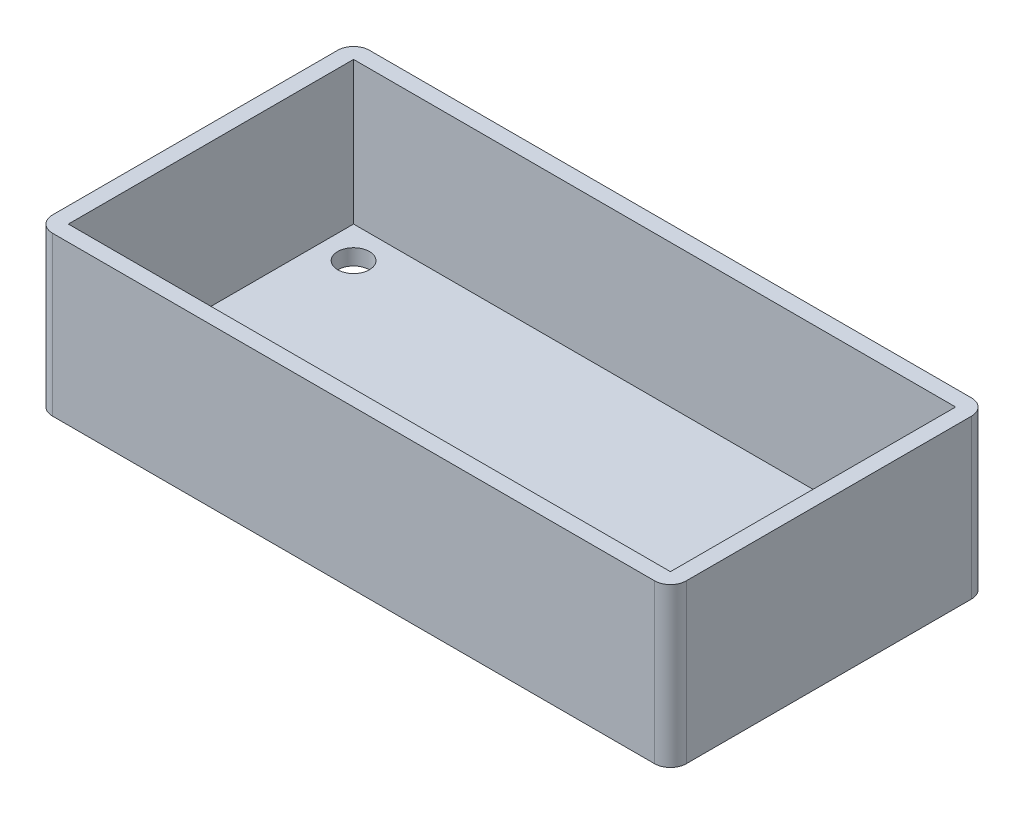
ISO-10303-21;
HEADER;
FILE_DESCRIPTION(('STEP AP214'),'2;1');
FILE_NAME('part.step','',(''),(''),'','','');
FILE_SCHEMA(('AUTOMOTIVE_DESIGN { 1 0 10303 214 1 1 1 1 }'));
ENDSEC;
DATA;
#1=APPLICATION_CONTEXT('core data for automotive mechanical design processes');
#2=APPLICATION_PROTOCOL_DEFINITION('international standard','automotive_design',2000,#1);
#3=PRODUCT_CONTEXT('',#1,'mechanical');
#4=PRODUCT('Part','Part','',(#3));
#5=PRODUCT_RELATED_PRODUCT_CATEGORY('part','',(#4));
#6=PRODUCT_DEFINITION_FORMATION('','',#4);
#7=PRODUCT_DEFINITION_CONTEXT('part definition',#1,'design');
#8=PRODUCT_DEFINITION('design','',#6,#7);
#9=PRODUCT_DEFINITION_SHAPE('','',#8);
#10=(LENGTH_UNIT() NAMED_UNIT(*) SI_UNIT(.MILLI.,.METRE.));
#11=(NAMED_UNIT(*) PLANE_ANGLE_UNIT() SI_UNIT($,.RADIAN.));
#12=(NAMED_UNIT(*) SI_UNIT($,.STERADIAN.) SOLID_ANGLE_UNIT());
#13=UNCERTAINTY_MEASURE_WITH_UNIT(LENGTH_MEASURE(1.E-05),#10,'distance_accuracy_value','');
#14=(GEOMETRIC_REPRESENTATION_CONTEXT(3) GLOBAL_UNCERTAINTY_ASSIGNED_CONTEXT((#13)) GLOBAL_UNIT_ASSIGNED_CONTEXT((#10,
#11,#12)) REPRESENTATION_CONTEXT('',''));
#15=CARTESIAN_POINT('',(0.,0.,0.));
#16=DIRECTION('',(0.,0.,1.));
#17=DIRECTION('',(1.,0.,0.));
#18=AXIS2_PLACEMENT_3D('',#15,#16,#17);
#19=CARTESIAN_POINT('',(-100.,50.,50.));
#20=DIRECTION('',(1.,0.,0.));
#21=DIRECTION('',(0.,0.,-1.));
#22=AXIS2_PLACEMENT_3D('',#19,#20,#21);
#23=PLANE('',#22);
#24=DIRECTION('',(0.,0.,1.));
#25=VECTOR('',#24,1.);
#26=CARTESIAN_POINT('',(-100.,0.,50.));
#27=LINE('',#26,#25);
#28=CARTESIAN_POINT('',(-100.,0.,-45.));
#29=VERTEX_POINT('',#28);
#30=CARTESIAN_POINT('',(-100.,0.,45.));
#31=VERTEX_POINT('',#30);
#32=EDGE_CURVE('E192',#29,#31,#27,.T.);
#33=ORIENTED_EDGE('',*,*,#32,.T.);
#34=DIRECTION('',(0.,-1.,0.));
#35=VECTOR('',#34,1.);
#36=CARTESIAN_POINT('',(-100.,50.,45.));
#37=LINE('',#36,#35);
#38=CARTESIAN_POINT('',(-100.,50.,45.));
#39=VERTEX_POINT('',#38);
#40=EDGE_CURVE('E11',#31,#39,#37,.F.);
#41=ORIENTED_EDGE('',*,*,#40,.T.);
#42=DIRECTION('',(0.,0.,1.));
#43=VECTOR('',#42,1.);
#44=CARTESIAN_POINT('',(-100.,50.,50.));
#45=LINE('',#44,#43);
#46=CARTESIAN_POINT('',(-100.,50.,-45.));
#47=VERTEX_POINT('',#46);
#48=EDGE_CURVE('E176',#47,#39,#45,.T.);
#49=ORIENTED_EDGE('',*,*,#48,.F.);
#50=DIRECTION('',(0.,-1.,0.));
#51=VECTOR('',#50,1.);
#52=CARTESIAN_POINT('',(-100.,50.,-45.));
#53=LINE('',#52,#51);
#54=EDGE_CURVE('E48',#47,#29,#53,.T.);
#55=ORIENTED_EDGE('',*,*,#54,.T.);
#56=EDGE_LOOP('',(#33,#41,#49,#55));
#57=FACE_BOUND('',#56,.T.);
#58=ADVANCED_FACE('F39',(#57),#23,.F.);
#59=CARTESIAN_POINT('',(100.,50.,50.));
#60=DIRECTION('',(0.,0.,-1.));
#61=DIRECTION('',(-1.,0.,0.));
#62=AXIS2_PLACEMENT_3D('',#59,#60,#61);
#63=PLANE('',#62);
#64=DIRECTION('',(1.,0.,0.));
#65=VECTOR('',#64,1.);
#66=CARTESIAN_POINT('',(100.,0.,50.));
#67=LINE('',#66,#65);
#68=CARTESIAN_POINT('',(-95.,0.,50.));
#69=VERTEX_POINT('',#68);
#70=CARTESIAN_POINT('',(95.,0.,50.));
#71=VERTEX_POINT('',#70);
#72=EDGE_CURVE('E196',#69,#71,#67,.T.);
#73=ORIENTED_EDGE('',*,*,#72,.T.);
#74=DIRECTION('',(0.,-1.,0.));
#75=VECTOR('',#74,1.);
#76=CARTESIAN_POINT('',(95.,50.,50.));
#77=LINE('',#76,#75);
#78=CARTESIAN_POINT('',(95.,50.,50.));
#79=VERTEX_POINT('',#78);
#80=EDGE_CURVE('E55',#71,#79,#77,.F.);
#81=ORIENTED_EDGE('',*,*,#80,.T.);
#82=DIRECTION('',(1.,0.,0.));
#83=VECTOR('',#82,1.);
#84=CARTESIAN_POINT('',(100.,50.,50.));
#85=LINE('',#84,#83);
#86=CARTESIAN_POINT('',(-95.,50.,50.));
#87=VERTEX_POINT('',#86);
#88=EDGE_CURVE('E179',#87,#79,#85,.T.);
#89=ORIENTED_EDGE('',*,*,#88,.F.);
#90=DIRECTION('',(0.,-1.,0.));
#91=VECTOR('',#90,1.);
#92=CARTESIAN_POINT('',(-95.,50.,50.));
#93=LINE('',#92,#91);
#94=EDGE_CURVE('E242',#87,#69,#93,.T.);
#95=ORIENTED_EDGE('',*,*,#94,.T.);
#96=EDGE_LOOP('',(#73,#81,#89,#95));
#97=FACE_BOUND('',#96,.T.);
#98=ADVANCED_FACE('F263',(#97),#63,.F.);
#99=CARTESIAN_POINT('',(100.,50.,50.));
#100=DIRECTION('',(-1.,0.,0.));
#101=DIRECTION('',(0.,0.,1.));
#102=AXIS2_PLACEMENT_3D('',#99,#100,#101);
#103=PLANE('',#102);
#104=DIRECTION('',(0.,0.,-1.));
#105=VECTOR('',#104,1.);
#106=CARTESIAN_POINT('',(100.,0.,50.));
#107=LINE('',#106,#105);
#108=CARTESIAN_POINT('',(100.,0.,45.));
#109=VERTEX_POINT('',#108);
#110=CARTESIAN_POINT('',(100.,0.,-45.));
#111=VERTEX_POINT('',#110);
#112=EDGE_CURVE('E199',#109,#111,#107,.T.);
#113=ORIENTED_EDGE('',*,*,#112,.T.);
#114=DIRECTION('',(0.,-1.,0.));
#115=VECTOR('',#114,1.);
#116=CARTESIAN_POINT('',(100.,50.,-45.));
#117=LINE('',#116,#115);
#118=CARTESIAN_POINT('',(100.,50.,-45.));
#119=VERTEX_POINT('',#118);
#120=EDGE_CURVE('E228',#111,#119,#117,.F.);
#121=ORIENTED_EDGE('',*,*,#120,.T.);
#122=DIRECTION('',(0.,0.,-1.));
#123=VECTOR('',#122,1.);
#124=CARTESIAN_POINT('',(100.,50.,50.));
#125=LINE('',#124,#123);
#126=CARTESIAN_POINT('',(100.,50.,45.));
#127=VERTEX_POINT('',#126);
#128=EDGE_CURVE('E183',#127,#119,#125,.T.);
#129=ORIENTED_EDGE('',*,*,#128,.F.);
#130=DIRECTION('',(0.,-1.,0.));
#131=VECTOR('',#130,1.);
#132=CARTESIAN_POINT('',(100.,50.,45.));
#133=LINE('',#132,#131);
#134=EDGE_CURVE('E224',#127,#109,#133,.T.);
#135=ORIENTED_EDGE('',*,*,#134,.T.);
#136=EDGE_LOOP('',(#113,#121,#129,#135));
#137=FACE_BOUND('',#136,.T.);
#138=ADVANCED_FACE('F272',(#137),#103,.F.);
#139=CARTESIAN_POINT('',(100.,50.,-50.));
#140=DIRECTION('',(0.,0.,1.));
#141=DIRECTION('',(1.,0.,0.));
#142=AXIS2_PLACEMENT_3D('',#139,#140,#141);
#143=PLANE('',#142);
#144=DIRECTION('',(-1.,0.,0.));
#145=VECTOR('',#144,1.);
#146=CARTESIAN_POINT('',(100.,50.,-50.));
#147=LINE('',#146,#145);
#148=CARTESIAN_POINT('',(95.,50.,-50.));
#149=VERTEX_POINT('',#148);
#150=CARTESIAN_POINT('',(-95.,50.,-50.));
#151=VERTEX_POINT('',#150);
#152=EDGE_CURVE('E187',#149,#151,#147,.T.);
#153=ORIENTED_EDGE('',*,*,#152,.F.);
#154=DIRECTION('',(0.,-1.,0.));
#155=VECTOR('',#154,1.);
#156=CARTESIAN_POINT('',(95.,50.,-50.));
#157=LINE('',#156,#155);
#158=CARTESIAN_POINT('',(95.,0.,-50.));
#159=VERTEX_POINT('',#158);
#160=EDGE_CURVE('E208',#149,#159,#157,.T.);
#161=ORIENTED_EDGE('',*,*,#160,.T.);
#162=DIRECTION('',(-1.,0.,0.));
#163=VECTOR('',#162,1.);
#164=CARTESIAN_POINT('',(100.,0.,-50.));
#165=LINE('',#164,#163);
#166=CARTESIAN_POINT('',(-95.,0.,-50.));
#167=VERTEX_POINT('',#166);
#168=EDGE_CURVE('E180',#159,#167,#165,.T.);
#169=ORIENTED_EDGE('',*,*,#168,.T.);
#170=DIRECTION('',(0.,-1.,0.));
#171=VECTOR('',#170,1.);
#172=CARTESIAN_POINT('',(-95.,50.,-50.));
#173=LINE('',#172,#171);
#174=EDGE_CURVE('E191',#167,#151,#173,.F.);
#175=ORIENTED_EDGE('',*,*,#174,.T.);
#176=EDGE_LOOP('',(#153,#161,#169,#175));
#177=FACE_BOUND('',#176,.T.);
#178=ADVANCED_FACE('F280',(#177),#143,.F.);
#179=CARTESIAN_POINT('',(0.,50.,0.));
#180=DIRECTION('',(0.,1.,0.));
#181=DIRECTION('',(0.,0.,1.));
#182=AXIS2_PLACEMENT_3D('',#179,#180,#181);
#183=PLANE('',#182);
#184=DIRECTION('',(0.,0.,1.));
#185=VECTOR('',#184,1.);
#186=CARTESIAN_POINT('',(-95.,50.,50.));
#187=LINE('',#186,#185);
#188=CARTESIAN_POINT('',(-95.,50.,-45.));
#189=VERTEX_POINT('',#188);
#190=CARTESIAN_POINT('',(-95.,50.,45.));
#191=VERTEX_POINT('',#190);
#192=EDGE_CURVE('E160',#189,#191,#187,.T.);
#193=ORIENTED_EDGE('',*,*,#192,.F.);
#194=DIRECTION('',(-1.,0.,0.));
#195=VECTOR('',#194,1.);
#196=CARTESIAN_POINT('',(100.,50.,-45.));
#197=LINE('',#196,#195);
#198=CARTESIAN_POINT('',(95.,50.,-45.));
#199=VERTEX_POINT('',#198);
#200=EDGE_CURVE('E173',#199,#189,#197,.T.);
#201=ORIENTED_EDGE('',*,*,#200,.F.);
#202=DIRECTION('',(0.,0.,-1.));
#203=VECTOR('',#202,1.);
#204=CARTESIAN_POINT('',(95.,50.,50.));
#205=LINE('',#204,#203);
#206=CARTESIAN_POINT('',(95.,50.,45.));
#207=VERTEX_POINT('',#206);
#208=EDGE_CURVE('E170',#207,#199,#205,.T.);
#209=ORIENTED_EDGE('',*,*,#208,.F.);
#210=DIRECTION('',(1.,0.,0.));
#211=VECTOR('',#210,1.);
#212=CARTESIAN_POINT('',(100.,50.,45.));
#213=LINE('',#212,#211);
#214=EDGE_CURVE('E146',#191,#207,#213,.T.);
#215=ORIENTED_EDGE('',*,*,#214,.F.);
#216=EDGE_LOOP('',(#193,#201,#209,#215));
#217=FACE_BOUND('',#216,.T.);
#218=ORIENTED_EDGE('',*,*,#128,.T.);
#219=CARTESIAN_POINT('',(95.,50.,-45.));
#220=DIRECTION('',(0.,1.,0.));
#221=DIRECTION('',(0.,0.,1.));
#222=AXIS2_PLACEMENT_3D('',#219,#220,#221);
#223=CIRCLE('',#222,5.);
#224=EDGE_CURVE('E239',#119,#149,#223,.T.);
#225=ORIENTED_EDGE('',*,*,#224,.T.);
#226=ORIENTED_EDGE('',*,*,#152,.T.);
#227=CARTESIAN_POINT('',(-95.,50.,-45.));
#228=DIRECTION('',(0.,1.,0.));
#229=DIRECTION('',(0.,0.,1.));
#230=AXIS2_PLACEMENT_3D('',#227,#228,#229);
#231=CIRCLE('',#230,5.);
#232=EDGE_CURVE('E231',#151,#47,#231,.T.);
#233=ORIENTED_EDGE('',*,*,#232,.T.);
#234=ORIENTED_EDGE('',*,*,#48,.T.);
#235=CARTESIAN_POINT('',(-95.,50.,45.));
#236=DIRECTION('',(0.,1.,0.));
#237=DIRECTION('',(0.,0.,1.));
#238=AXIS2_PLACEMENT_3D('',#235,#236,#237);
#239=CIRCLE('',#238,5.);
#240=EDGE_CURVE('E62',#39,#87,#239,.T.);
#241=ORIENTED_EDGE('',*,*,#240,.T.);
#242=ORIENTED_EDGE('',*,*,#88,.T.);
#243=CARTESIAN_POINT('',(95.,50.,45.));
#244=DIRECTION('',(0.,1.,0.));
#245=DIRECTION('',(0.,0.,1.));
#246=AXIS2_PLACEMENT_3D('',#243,#244,#245);
#247=CIRCLE('',#246,5.);
#248=EDGE_CURVE('E236',#79,#127,#247,.T.);
#249=ORIENTED_EDGE('',*,*,#248,.T.);
#250=EDGE_LOOP('',(#218,#225,#226,#233,#234,#241,#242,#249));
#251=FACE_BOUND('',#250,.T.);
#252=ADVANCED_FACE('F265',(#217,#251),#183,.T.);
#253=CARTESIAN_POINT('',(0.,0.,0.));
#254=DIRECTION('',(0.,1.,0.));
#255=DIRECTION('',(0.,0.,1.));
#256=AXIS2_PLACEMENT_3D('',#253,#254,#255);
#257=PLANE('',#256);
#258=CARTESIAN_POINT('',(-85.,0.,35.));
#259=DIRECTION('',(0.,1.,0.));
#260=DIRECTION('',(0.,0.,1.));
#261=AXIS2_PLACEMENT_3D('',#258,#259,#260);
#262=CIRCLE('',#261,5.00000000000001);
#263=CARTESIAN_POINT('',(-85.,0.,40.));
#264=VERTEX_POINT('',#263);
#265=EDGE_CURVE('E475',#264,#264,#262,.T.);
#266=ORIENTED_EDGE('',*,*,#265,.T.);
#267=EDGE_LOOP('',(#266));
#268=FACE_BOUND('',#267,.T.);
#269=CARTESIAN_POINT('',(85.,0.,35.));
#270=DIRECTION('',(0.,1.,0.));
#271=DIRECTION('',(0.,0.,1.));
#272=AXIS2_PLACEMENT_3D('',#269,#270,#271);
#273=CIRCLE('',#272,4.99999999999999);
#274=CARTESIAN_POINT('',(85.,0.,40.));
#275=VERTEX_POINT('',#274);
#276=EDGE_CURVE('E483',#275,#275,#273,.T.);
#277=ORIENTED_EDGE('',*,*,#276,.T.);
#278=EDGE_LOOP('',(#277));
#279=FACE_BOUND('',#278,.T.);
#280=CARTESIAN_POINT('',(85.,0.,-35.));
#281=DIRECTION('',(0.,1.,0.));
#282=DIRECTION('',(0.,0.,1.));
#283=AXIS2_PLACEMENT_3D('',#280,#281,#282);
#284=CIRCLE('',#283,4.99999999999999);
#285=CARTESIAN_POINT('',(85.,0.,-30.));
#286=VERTEX_POINT('',#285);
#287=EDGE_CURVE('E469',#286,#286,#284,.T.);
#288=ORIENTED_EDGE('',*,*,#287,.T.);
#289=EDGE_LOOP('',(#288));
#290=FACE_BOUND('',#289,.T.);
#291=CARTESIAN_POINT('',(-85.,0.,-35.));
#292=DIRECTION('',(0.,1.,0.));
#293=DIRECTION('',(0.,0.,1.));
#294=AXIS2_PLACEMENT_3D('',#291,#292,#293);
#295=CIRCLE('',#294,5.00000000000001);
#296=CARTESIAN_POINT('',(-85.,0.,-30.));
#297=VERTEX_POINT('',#296);
#298=EDGE_CURVE('E460',#297,#297,#295,.T.);
#299=ORIENTED_EDGE('',*,*,#298,.T.);
#300=EDGE_LOOP('',(#299));
#301=FACE_BOUND('',#300,.T.);
#302=ORIENTED_EDGE('',*,*,#168,.F.);
#303=CARTESIAN_POINT('',(95.,0.,-45.));
#304=DIRECTION('',(0.,1.,0.));
#305=DIRECTION('',(0.,0.,1.));
#306=AXIS2_PLACEMENT_3D('',#303,#304,#305);
#307=CIRCLE('',#306,5.);
#308=EDGE_CURVE('E221',#159,#111,#307,.F.);
#309=ORIENTED_EDGE('',*,*,#308,.T.);
#310=ORIENTED_EDGE('',*,*,#112,.F.);
#311=CARTESIAN_POINT('',(95.,0.,45.));
#312=DIRECTION('',(0.,1.,0.));
#313=DIRECTION('',(0.,0.,1.));
#314=AXIS2_PLACEMENT_3D('',#311,#312,#313);
#315=CIRCLE('',#314,5.);
#316=EDGE_CURVE('E218',#109,#71,#315,.F.);
#317=ORIENTED_EDGE('',*,*,#316,.T.);
#318=ORIENTED_EDGE('',*,*,#72,.F.);
#319=CARTESIAN_POINT('',(-95.,0.,45.));
#320=DIRECTION('',(0.,1.,0.));
#321=DIRECTION('',(0.,0.,1.));
#322=AXIS2_PLACEMENT_3D('',#319,#320,#321);
#323=CIRCLE('',#322,5.);
#324=EDGE_CURVE('E215',#69,#31,#323,.F.);
#325=ORIENTED_EDGE('',*,*,#324,.T.);
#326=ORIENTED_EDGE('',*,*,#32,.F.);
#327=CARTESIAN_POINT('',(-95.,0.,-45.));
#328=DIRECTION('',(0.,1.,0.));
#329=DIRECTION('',(0.,0.,1.));
#330=AXIS2_PLACEMENT_3D('',#327,#328,#329);
#331=CIRCLE('',#330,5.);
#332=EDGE_CURVE('E212',#29,#167,#331,.F.);
#333=ORIENTED_EDGE('',*,*,#332,.T.);
#334=EDGE_LOOP('',(#302,#309,#310,#317,#318,#325,#326,#333));
#335=FACE_BOUND('',#334,.T.);
#336=ADVANCED_FACE('F258',(#268,#279,#290,#301,#335),#257,.F.);
#337=CARTESIAN_POINT('',(-95.,50.,50.));
#338=DIRECTION('',(1.,0.,0.));
#339=DIRECTION('',(0.,0.,-1.));
#340=AXIS2_PLACEMENT_3D('',#337,#338,#339);
#341=PLANE('',#340);
#342=DIRECTION('',(0.,0.,1.));
#343=VECTOR('',#342,1.);
#344=CARTESIAN_POINT('',(-95.,5.,50.));
#345=LINE('',#344,#343);
#346=CARTESIAN_POINT('',(-95.,5.,-45.));
#347=VERTEX_POINT('',#346);
#348=CARTESIAN_POINT('',(-95.,5.,45.));
#349=VERTEX_POINT('',#348);
#350=EDGE_CURVE('E136',#347,#349,#345,.T.);
#351=ORIENTED_EDGE('',*,*,#350,.F.);
#352=DIRECTION('',(0.,-1.,0.));
#353=VECTOR('',#352,1.);
#354=CARTESIAN_POINT('',(-95.,50.,-45.));
#355=LINE('',#354,#353);
#356=EDGE_CURVE('E164',#189,#347,#355,.T.);
#357=ORIENTED_EDGE('',*,*,#356,.F.);
#358=ORIENTED_EDGE('',*,*,#192,.T.);
#359=DIRECTION('',(0.,-1.,0.));
#360=VECTOR('',#359,1.);
#361=CARTESIAN_POINT('',(-95.,50.,45.));
#362=LINE('',#361,#360);
#363=EDGE_CURVE('E151',#191,#349,#362,.T.);
#364=ORIENTED_EDGE('',*,*,#363,.T.);
#365=EDGE_LOOP('',(#351,#357,#358,#364));
#366=FACE_BOUND('',#365,.T.);
#367=ADVANCED_FACE('F325',(#366),#341,.T.);
#368=CARTESIAN_POINT('',(100.,50.,45.));
#369=DIRECTION('',(0.,0.,-1.));
#370=DIRECTION('',(-1.,0.,0.));
#371=AXIS2_PLACEMENT_3D('',#368,#369,#370);
#372=PLANE('',#371);
#373=DIRECTION('',(1.,0.,0.));
#374=VECTOR('',#373,1.);
#375=CARTESIAN_POINT('',(100.,5.,45.));
#376=LINE('',#375,#374);
#377=CARTESIAN_POINT('',(95.,5.,45.));
#378=VERTEX_POINT('',#377);
#379=EDGE_CURVE('E129',#349,#378,#376,.T.);
#380=ORIENTED_EDGE('',*,*,#379,.F.);
#381=ORIENTED_EDGE('',*,*,#363,.F.);
#382=ORIENTED_EDGE('',*,*,#214,.T.);
#383=DIRECTION('',(0.,-1.,0.));
#384=VECTOR('',#383,1.);
#385=CARTESIAN_POINT('',(95.,50.,45.));
#386=LINE('',#385,#384);
#387=EDGE_CURVE('E143',#207,#378,#386,.T.);
#388=ORIENTED_EDGE('',*,*,#387,.T.);
#389=EDGE_LOOP('',(#380,#381,#382,#388));
#390=FACE_BOUND('',#389,.T.);
#391=ADVANCED_FACE('F144',(#390),#372,.T.);
#392=CARTESIAN_POINT('',(95.,50.,50.));
#393=DIRECTION('',(-1.,0.,0.));
#394=DIRECTION('',(0.,0.,1.));
#395=AXIS2_PLACEMENT_3D('',#392,#393,#394);
#396=PLANE('',#395);
#397=DIRECTION('',(0.,0.,-1.));
#398=VECTOR('',#397,1.);
#399=CARTESIAN_POINT('',(95.,5.,50.));
#400=LINE('',#399,#398);
#401=CARTESIAN_POINT('',(95.,5.,-45.));
#402=VERTEX_POINT('',#401);
#403=EDGE_CURVE('E133',#378,#402,#400,.T.);
#404=ORIENTED_EDGE('',*,*,#403,.F.);
#405=ORIENTED_EDGE('',*,*,#387,.F.);
#406=ORIENTED_EDGE('',*,*,#208,.T.);
#407=DIRECTION('',(0.,-1.,0.));
#408=VECTOR('',#407,1.);
#409=CARTESIAN_POINT('',(95.,50.,-45.));
#410=LINE('',#409,#408);
#411=EDGE_CURVE('E152',#199,#402,#410,.T.);
#412=ORIENTED_EDGE('',*,*,#411,.T.);
#413=EDGE_LOOP('',(#404,#405,#406,#412));
#414=FACE_BOUND('',#413,.T.);
#415=ADVANCED_FACE('F154',(#414),#396,.T.);
#416=CARTESIAN_POINT('',(100.,50.,-45.));
#417=DIRECTION('',(0.,0.,1.));
#418=DIRECTION('',(1.,0.,0.));
#419=AXIS2_PLACEMENT_3D('',#416,#417,#418);
#420=PLANE('',#419);
#421=DIRECTION('',(-1.,0.,0.));
#422=VECTOR('',#421,1.);
#423=CARTESIAN_POINT('',(100.,5.,-45.));
#424=LINE('',#423,#422);
#425=EDGE_CURVE('E157',#402,#347,#424,.T.);
#426=ORIENTED_EDGE('',*,*,#425,.F.);
#427=ORIENTED_EDGE('',*,*,#411,.F.);
#428=ORIENTED_EDGE('',*,*,#200,.T.);
#429=ORIENTED_EDGE('',*,*,#356,.T.);
#430=EDGE_LOOP('',(#426,#427,#428,#429));
#431=FACE_BOUND('',#430,.T.);
#432=ADVANCED_FACE('F338',(#431),#420,.T.);
#433=CARTESIAN_POINT('',(0.,5.,0.));
#434=DIRECTION('',(0.,1.,0.));
#435=DIRECTION('',(0.,0.,1.));
#436=AXIS2_PLACEMENT_3D('',#433,#434,#435);
#437=PLANE('',#436);
#438=CARTESIAN_POINT('',(-85.,5.,35.));
#439=DIRECTION('',(0.,1.,0.));
#440=DIRECTION('',(0.,0.,1.));
#441=AXIS2_PLACEMENT_3D('',#438,#439,#440);
#442=CIRCLE('',#441,5.00000000000001);
#443=CARTESIAN_POINT('',(-85.,5.,40.));
#444=VERTEX_POINT('',#443);
#445=EDGE_CURVE('E471',#444,#444,#442,.T.);
#446=ORIENTED_EDGE('',*,*,#445,.F.);
#447=EDGE_LOOP('',(#446));
#448=FACE_BOUND('',#447,.T.);
#449=CARTESIAN_POINT('',(85.,5.,35.));
#450=DIRECTION('',(0.,1.,0.));
#451=DIRECTION('',(0.,0.,1.));
#452=AXIS2_PLACEMENT_3D('',#449,#450,#451);
#453=CIRCLE('',#452,4.99999999999999);
#454=CARTESIAN_POINT('',(85.,5.,40.));
#455=VERTEX_POINT('',#454);
#456=EDGE_CURVE('E479',#455,#455,#453,.T.);
#457=ORIENTED_EDGE('',*,*,#456,.F.);
#458=EDGE_LOOP('',(#457));
#459=FACE_BOUND('',#458,.T.);
#460=CARTESIAN_POINT('',(85.,5.,-35.));
#461=DIRECTION('',(0.,1.,0.));
#462=DIRECTION('',(0.,0.,1.));
#463=AXIS2_PLACEMENT_3D('',#460,#461,#462);
#464=CIRCLE('',#463,4.99999999999999);
#465=CARTESIAN_POINT('',(85.,5.,-30.));
#466=VERTEX_POINT('',#465);
#467=EDGE_CURVE('E487',#466,#466,#464,.T.);
#468=ORIENTED_EDGE('',*,*,#467,.F.);
#469=EDGE_LOOP('',(#468));
#470=FACE_BOUND('',#469,.T.);
#471=CARTESIAN_POINT('',(-85.,5.,-35.));
#472=DIRECTION('',(0.,1.,0.));
#473=DIRECTION('',(0.,0.,1.));
#474=AXIS2_PLACEMENT_3D('',#471,#472,#473);
#475=CIRCLE('',#474,5.00000000000001);
#476=CARTESIAN_POINT('',(-85.,5.,-30.));
#477=VERTEX_POINT('',#476);
#478=EDGE_CURVE('E463',#477,#477,#475,.T.);
#479=ORIENTED_EDGE('',*,*,#478,.F.);
#480=EDGE_LOOP('',(#479));
#481=FACE_BOUND('',#480,.T.);
#482=ORIENTED_EDGE('',*,*,#350,.T.);
#483=ORIENTED_EDGE('',*,*,#379,.T.);
#484=ORIENTED_EDGE('',*,*,#403,.T.);
#485=ORIENTED_EDGE('',*,*,#425,.T.);
#486=EDGE_LOOP('',(#482,#483,#484,#485));
#487=FACE_BOUND('',#486,.T.);
#488=ADVANCED_FACE('F131',(#448,#459,#470,#481,#487),#437,.T.);
#489=CARTESIAN_POINT('',(95.,50.,-45.));
#490=DIRECTION('',(0.,-1.,0.));
#491=DIRECTION('',(0.,0.,-1.));
#492=AXIS2_PLACEMENT_3D('',#489,#490,#491);
#493=CYLINDRICAL_SURFACE('',#492,5.);
#494=ORIENTED_EDGE('',*,*,#224,.F.);
#495=ORIENTED_EDGE('',*,*,#120,.F.);
#496=ORIENTED_EDGE('',*,*,#308,.F.);
#497=ORIENTED_EDGE('',*,*,#160,.F.);
#498=EDGE_LOOP('',(#494,#495,#496,#497));
#499=FACE_BOUND('',#498,.T.);
#500=ADVANCED_FACE('F277',(#499),#493,.T.);
#501=CARTESIAN_POINT('',(95.,50.,45.));
#502=DIRECTION('',(0.,-1.,0.));
#503=DIRECTION('',(0.,0.,-1.));
#504=AXIS2_PLACEMENT_3D('',#501,#502,#503);
#505=CYLINDRICAL_SURFACE('',#504,5.);
#506=ORIENTED_EDGE('',*,*,#248,.F.);
#507=ORIENTED_EDGE('',*,*,#80,.F.);
#508=ORIENTED_EDGE('',*,*,#316,.F.);
#509=ORIENTED_EDGE('',*,*,#134,.F.);
#510=EDGE_LOOP('',(#506,#507,#508,#509));
#511=FACE_BOUND('',#510,.T.);
#512=ADVANCED_FACE('F269',(#511),#505,.T.);
#513=CARTESIAN_POINT('',(-95.,50.,45.));
#514=DIRECTION('',(0.,-1.,0.));
#515=DIRECTION('',(0.,0.,-1.));
#516=AXIS2_PLACEMENT_3D('',#513,#514,#515);
#517=CYLINDRICAL_SURFACE('',#516,5.);
#518=ORIENTED_EDGE('',*,*,#240,.F.);
#519=ORIENTED_EDGE('',*,*,#40,.F.);
#520=ORIENTED_EDGE('',*,*,#324,.F.);
#521=ORIENTED_EDGE('',*,*,#94,.F.);
#522=EDGE_LOOP('',(#518,#519,#520,#521));
#523=FACE_BOUND('',#522,.T.);
#524=ADVANCED_FACE('F262',(#523),#517,.T.);
#525=CARTESIAN_POINT('',(-95.,50.,-45.));
#526=DIRECTION('',(0.,-1.,0.));
#527=DIRECTION('',(0.,0.,-1.));
#528=AXIS2_PLACEMENT_3D('',#525,#526,#527);
#529=CYLINDRICAL_SURFACE('',#528,5.);
#530=ORIENTED_EDGE('',*,*,#232,.F.);
#531=ORIENTED_EDGE('',*,*,#174,.F.);
#532=ORIENTED_EDGE('',*,*,#332,.F.);
#533=ORIENTED_EDGE('',*,*,#54,.F.);
#534=EDGE_LOOP('',(#530,#531,#532,#533));
#535=FACE_BOUND('',#534,.T.);
#536=ADVANCED_FACE('F41',(#535),#529,.T.);
#537=CARTESIAN_POINT('',(-85.,0.,-35.));
#538=DIRECTION('',(0.,1.,0.));
#539=DIRECTION('',(0.,0.,1.));
#540=AXIS2_PLACEMENT_3D('',#537,#538,#539);
#541=CYLINDRICAL_SURFACE('',#540,5.00000000000001);
#542=ORIENTED_EDGE('',*,*,#298,.F.);
#543=EDGE_LOOP('',(#542));
#544=FACE_BOUND('',#543,.T.);
#545=ORIENTED_EDGE('',*,*,#478,.T.);
#546=EDGE_LOOP('',(#545));
#547=FACE_BOUND('',#546,.T.);
#548=ADVANCED_FACE('F283',(#544,#547),#541,.F.);
#549=CARTESIAN_POINT('',(85.,0.,-35.));
#550=DIRECTION('',(0.,1.,0.));
#551=DIRECTION('',(0.,0.,1.));
#552=AXIS2_PLACEMENT_3D('',#549,#550,#551);
#553=CYLINDRICAL_SURFACE('',#552,4.99999999999999);
#554=ORIENTED_EDGE('',*,*,#287,.F.);
#555=EDGE_LOOP('',(#554));
#556=FACE_BOUND('',#555,.T.);
#557=ORIENTED_EDGE('',*,*,#467,.T.);
#558=EDGE_LOOP('',(#557));
#559=FACE_BOUND('',#558,.T.);
#560=ADVANCED_FACE('F288',(#556,#559),#553,.F.);
#561=CARTESIAN_POINT('',(85.,0.,35.));
#562=DIRECTION('',(0.,1.,0.));
#563=DIRECTION('',(0.,0.,1.));
#564=AXIS2_PLACEMENT_3D('',#561,#562,#563);
#565=CYLINDRICAL_SURFACE('',#564,4.99999999999999);
#566=ORIENTED_EDGE('',*,*,#276,.F.);
#567=EDGE_LOOP('',(#566));
#568=FACE_BOUND('',#567,.T.);
#569=ORIENTED_EDGE('',*,*,#456,.T.);
#570=EDGE_LOOP('',(#569));
#571=FACE_BOUND('',#570,.T.);
#572=ADVANCED_FACE('F356',(#568,#571),#565,.F.);
#573=CARTESIAN_POINT('',(-85.,0.,35.));
#574=DIRECTION('',(0.,1.,0.));
#575=DIRECTION('',(0.,0.,1.));
#576=AXIS2_PLACEMENT_3D('',#573,#574,#575);
#577=CYLINDRICAL_SURFACE('',#576,5.00000000000001);
#578=ORIENTED_EDGE('',*,*,#265,.F.);
#579=EDGE_LOOP('',(#578));
#580=FACE_BOUND('',#579,.T.);
#581=ORIENTED_EDGE('',*,*,#445,.T.);
#582=EDGE_LOOP('',(#581));
#583=FACE_BOUND('',#582,.T.);
#584=ADVANCED_FACE('F366',(#580,#583),#577,.F.);
#585=CLOSED_SHELL('',(#58,#98,#138,#178,#252,#336,#367,#391,#415,#432,#488,#500,#512,#524,#536,
#548,#560,#572,#584));
#586=MANIFOLD_SOLID_BREP('B2',#585);
#587=ADVANCED_BREP_SHAPE_REPRESENTATION('',(#18,#586),#14);
#588=SHAPE_DEFINITION_REPRESENTATION(#9,#587);
ENDSEC;
END-ISO-10303-21;
